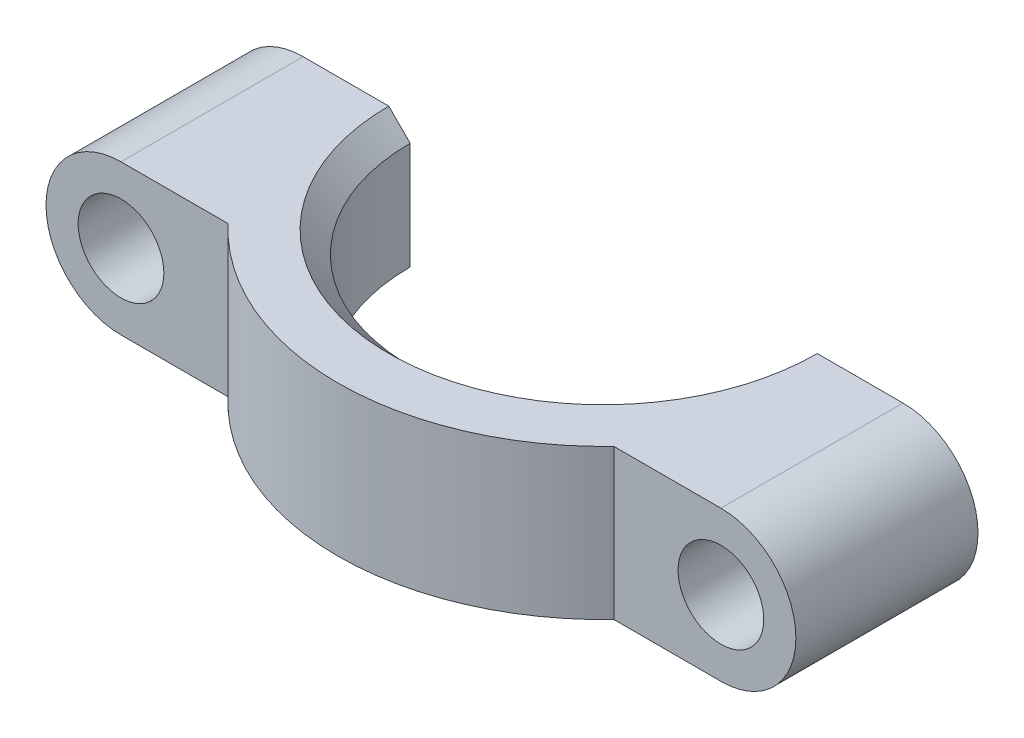
ISO-10303-21;
HEADER;
FILE_DESCRIPTION(('STEP AP214'),'2;1');
FILE_NAME('part.step','',(''),(''),'','','');
FILE_SCHEMA(('AUTOMOTIVE_DESIGN { 1 0 10303 214 1 1 1 1 }'));
ENDSEC;
DATA;
#1=APPLICATION_CONTEXT('core data for automotive mechanical design processes');
#2=APPLICATION_PROTOCOL_DEFINITION('international standard','automotive_design',2000,#1);
#3=PRODUCT_CONTEXT('',#1,'mechanical');
#4=PRODUCT('Part','Part','',(#3));
#5=PRODUCT_RELATED_PRODUCT_CATEGORY('part','',(#4));
#6=PRODUCT_DEFINITION_FORMATION('','',#4);
#7=PRODUCT_DEFINITION_CONTEXT('part definition',#1,'design');
#8=PRODUCT_DEFINITION('design','',#6,#7);
#9=PRODUCT_DEFINITION_SHAPE('','',#8);
#10=(LENGTH_UNIT() NAMED_UNIT(*) SI_UNIT(.MILLI.,.METRE.));
#11=(NAMED_UNIT(*) PLANE_ANGLE_UNIT() SI_UNIT($,.RADIAN.));
#12=(NAMED_UNIT(*) SI_UNIT($,.STERADIAN.) SOLID_ANGLE_UNIT());
#13=UNCERTAINTY_MEASURE_WITH_UNIT(LENGTH_MEASURE(1.E-05),#10,'distance_accuracy_value','');
#14=(GEOMETRIC_REPRESENTATION_CONTEXT(3) GLOBAL_UNCERTAINTY_ASSIGNED_CONTEXT((#13)) GLOBAL_UNIT_ASSIGNED_CONTEXT((#10,
#11,#12)) REPRESENTATION_CONTEXT('',''));
#15=CARTESIAN_POINT('',(0.,0.,0.));
#16=DIRECTION('',(0.,0.,1.));
#17=DIRECTION('',(1.,0.,0.));
#18=AXIS2_PLACEMENT_3D('',#15,#16,#17);
#19=CARTESIAN_POINT('',(14.0000000022828,3.5,2.1559629082013E-09));
#20=DIRECTION('',(0.,-1.,0.));
#21=DIRECTION('',(0.,0.,-1.));
#22=AXIS2_PLACEMENT_3D('',#19,#20,#21);
#23=CYLINDRICAL_SURFACE('',#22,12.3794184);
#24=CARTESIAN_POINT('',(1.62058160228278,1.17205600136793,2.15596518226357E-09));
#25=CARTESIAN_POINT('',(1.62058070106676,1.17204664313094,0.0824775925536557));
#26=CARTESIAN_POINT('',(1.62140589643494,1.1709161105799,0.164955447988266));
#27=CARTESIAN_POINT('',(1.62470168765311,1.1663441589203,0.329827057039448));
#28=CARTESIAN_POINT('',(1.62717254635869,1.16290237064286,0.412220795114308));
#29=CARTESIAN_POINT('',(1.63377268951064,1.15361142558453,0.577308928127511));
#30=CARTESIAN_POINT('',(1.63791187573793,1.14774789013258,0.660002143808955));
#31=CARTESIAN_POINT('',(1.64782891991983,1.13345955911073,0.825053900848175));
#32=CARTESIAN_POINT('',(1.65360669074367,1.1250348997254,0.907412459765));
#33=CARTESIAN_POINT('',(1.67398840396854,1.09472254150796,1.16151970390293));
#34=CARTESIAN_POINT('',(1.69133654965134,1.06818476466086,1.33257283641573));
#35=CARTESIAN_POINT('',(1.72229793291954,1.01689105610724,1.58596355240279));
#36=CARTESIAN_POINT('',(1.7334261297223,0.997906751014487,1.66980204441776));
#37=CARTESIAN_POINT('',(1.75721434762949,0.955405579054397,1.83609232104951));
#38=CARTESIAN_POINT('',(1.76987366734408,0.931890784646908,1.91854472105105));
#39=CARTESIAN_POINT('',(1.79184500230982,0.888623403614391,2.05275791223458));
#40=CARTESIAN_POINT('',(1.8007650115737,0.870464042916723,2.1050975264016));
#41=CARTESIAN_POINT('',(1.81909892254828,0.831471653186046,2.20871342381947));
#42=CARTESIAN_POINT('',(1.82851298012735,0.810637777329915,2.25998936428382));
#43=CARTESIAN_POINT('',(1.84764360380866,0.766027311175492,2.36068603645154));
#44=CARTESIAN_POINT('',(1.85735708760954,0.742276027004788,2.41011846331688));
#45=CARTESIAN_POINT('',(1.87698933162185,0.691131393325687,2.50700018681044));
#46=CARTESIAN_POINT('',(1.88690793281186,0.663740782039211,2.55445093950927));
#47=CARTESIAN_POINT('',(1.90573450500722,0.607428944012412,2.64207294426204));
#48=CARTESIAN_POINT('',(1.91464679504575,0.578916803507779,2.6825030210978));
#49=CARTESIAN_POINT('',(1.93215537892905,0.517492357770973,2.76020166434233));
#50=CARTESIAN_POINT('',(1.94075075074488,0.48456833484869,2.79746136403339));
#51=CARTESIAN_POINT('',(1.95724020985852,0.413021224620082,2.86762115631542));
#52=CARTESIAN_POINT('',(1.96512089975336,0.374315492998507,2.90044209071552));
#53=CARTESIAN_POINT('',(1.97914930554692,0.291066231692813,2.95804436551448));
#54=CARTESIAN_POINT('',(1.98530655623071,0.246556902269624,2.98287005881747));
#55=CARTESIAN_POINT('',(1.99271291764378,0.172694460427645,3.01250448217808));
#56=CARTESIAN_POINT('',(1.99493408650214,0.145051940281912,3.02133035142867));
#57=CARTESIAN_POINT('',(1.99823390396384,0.0886346171145662,3.03441208116168));
#58=CARTESIAN_POINT('',(1.99931361348157,0.0598608913273075,3.03867218528537));
#59=CARTESIAN_POINT('',(2.00020973673916,0.00188840981385083,3.04220933887906));
#60=CARTESIAN_POINT('',(2.00002206682872,-0.0273114170471196,3.04147028042818));
#61=CARTESIAN_POINT('',(1.99839728065709,-0.0851284536634222,3.03505222326563));
#62=CARTESIAN_POINT('',(1.99695935986068,-0.113745276118205,3.02937004365908));
#63=CARTESIAN_POINT('',(1.99262451982069,-0.174780535180429,3.01214623578604));
#64=CARTESIAN_POINT('',(1.98950794873546,-0.206930497204879,2.99971933775454));
#65=CARTESIAN_POINT('',(1.98211199860328,-0.268711187279559,2.96994996356882));
#66=CARTESIAN_POINT('',(1.97783056563568,-0.298337342955653,2.95259880244937));
#67=CARTESIAN_POINT('',(1.96600170967453,-0.369808072741913,2.90409774919046));
#68=CARTESIAN_POINT('',(1.95792117253801,-0.409879217855081,2.87049119072248));
#69=CARTESIAN_POINT('',(1.94082510134456,-0.484423590391346,2.7978038260427));
#70=CARTESIAN_POINT('',(1.93180725914709,-0.51888243543077,2.75870941878553));
#71=CARTESIAN_POINT('',(1.91382538555792,-0.58162297477863,2.67880293611691));
#72=CARTESIAN_POINT('',(1.90487736881377,-0.610113568270055,2.63814852994299));
#73=CARTESIAN_POINT('',(1.88694180825091,-0.66350620627804,2.55453678465069));
#74=CARTESIAN_POINT('',(1.87795423518509,-0.688404852684239,2.51157731688095));
#75=CARTESIAN_POINT('',(1.85120790764819,-0.758663560396669,2.38008927724707));
#76=CARTESIAN_POINT('',(1.83369780087158,-0.799483625970508,2.28909252169126));
#77=CARTESIAN_POINT('',(1.79818963499578,-0.876646668902664,2.09214381000132));
#78=CARTESIAN_POINT('',(1.780393072304,-0.91183432651444,1.98572249363806));
#79=CARTESIAN_POINT('',(1.74728301353439,-0.973769399639217,1.76998806146417));
#80=CARTESIAN_POINT('',(1.73197248235464,-1.00050677258096,1.66067167095143));
#81=CARTESIAN_POINT('',(1.70412746754681,-1.04722785945669,1.44010466302931));
#82=CARTESIAN_POINT('',(1.69159739419007,-1.06720087001176,1.32885127037612));
#83=CARTESIAN_POINT('',(1.66949986845427,-1.10144506807773,1.10517243298978));
#84=CARTESIAN_POINT('',(1.65993309525673,-1.11571494866171,0.992746725659151));
#85=CARTESIAN_POINT('',(1.64146247581991,-1.1427820480408,0.733540765076906));
#86=CARTESIAN_POINT('',(1.63360531527481,-1.15387387191845,0.586504482153202));
#87=CARTESIAN_POINT('',(1.62577949927132,-1.16484159824108,0.366098113739254));
#88=CARTESIAN_POINT('',(1.62383086955804,-1.16755280693986,0.292917545083328));
#89=CARTESIAN_POINT('',(1.62123189410597,-1.17115787710361,0.146493301418139));
#90=CARTESIAN_POINT('',(1.62058146270267,-1.17205185848244,0.0732496308919003));
#91=CARTESIAN_POINT('',(1.62058160228278,-1.17205600136799,2.15597160438255E-09));
#92=B_SPLINE_CURVE_WITH_KNOTS('',3,(#24,#25,#26,#27,#28,#29,#30,#31,#32,#33,#34,#35,#36,#37,#38,
#39,#40,#41,#42,#43,#44,#45,#46,#47,#48,#49,#50,#51,#52,#53,#54,#55,#56,#57,#58,#59,#60,#61,#62,
#63,#64,#65,#66,#67,#68,#69,#70,#71,#72,#73,#74,#75,#76,#77,#78,#79,#80,#81,#82,#83,#84,#85,#86,
#87,#88,#89,#90,#91),.UNSPECIFIED.,.F.,.F.,(4,2,2,2,2,2,2,2,2,2,2,2,2,2,2,2,2,2,2,2,2,2,2,2,2,2,
2,2,2,2,2,2,2,4),(0.,0.24742073320188,0.494880995463496,0.743832123687778,0.992770016560819,
1.51382281337372,1.77375838789471,2.03357533671996,2.2018566198619,2.37019131739323,
2.53715720736888,2.70399817652613,2.85458504178582,3.00558009107777,3.1589874160217,
3.31152845118714,3.39849010019237,3.48537085258451,3.57253167856633,3.65974863400002,
3.76300210331749,3.86643882563878,4.02430220545093,4.18256397699681,4.3336675201235,
4.48491308813585,4.78793247477925,5.12795273110068,5.46837557126951,5.80933457943281,
6.15037167688319,6.59301455795597,6.81275731194246,7.03248556523715),.UNSPECIFIED.);
#93=CARTESIAN_POINT('',(1.62058160228278,1.17205600136793,0.));
#94=VERTEX_POINT('',#93);
#95=CARTESIAN_POINT('',(1.62058160228278,-1.17205600136793,2.1559629082013E-09));
#96=VERTEX_POINT('',#95);
#97=EDGE_CURVE('E194',#94,#96,#92,.T.);
#98=ORIENTED_EDGE('',*,*,#97,.F.);
#99=DIRECTION('',(0.,-1.,0.));
#100=VECTOR('',#99,1.);
#101=CARTESIAN_POINT('',(1.62058160228278,3.5,2.1559629082013E-09));
#102=LINE('',#101,#100);
#103=EDGE_CURVE('E158',#94,#96,#102,.T.);
#104=ORIENTED_EDGE('',*,*,#103,.T.);
#105=EDGE_LOOP('',(#98,#104));
#106=FACE_BOUND('',#105,.T.);
#107=ADVANCED_FACE('F33',(#106),#23,.T.);
#108=CARTESIAN_POINT('',(0.,-3.50000000000001,8.5));
#109=DIRECTION('',(0.,1.,0.));
#110=DIRECTION('',(-1.,0.,0.));
#111=AXIS2_PLACEMENT_3D('',#108,#109,#110);
#112=PLANE('',#111);
#113=DIRECTION('',(1.,0.,0.));
#114=VECTOR('',#113,1.);
#115=CARTESIAN_POINT('',(1.62058160228278,-3.5,2.1559629082013E-09));
#116=LINE('',#115,#114);
#117=CARTESIAN_POINT('',(0.,-3.5,0.));
#118=VERTEX_POINT('',#117);
#119=CARTESIAN_POINT('',(4.00000000228278,-3.5,2.1559629082013E-09));
#120=VERTEX_POINT('',#119);
#121=EDGE_CURVE('E151',#118,#120,#116,.T.);
#122=ORIENTED_EDGE('',*,*,#121,.T.);
#123=CARTESIAN_POINT('',(14.0000000022828,-3.50000000000001,2.1559629082013E-09));
#124=DIRECTION('',(0.,1.,0.));
#125=DIRECTION('',(-1.,0.,0.));
#126=AXIS2_PLACEMENT_3D('',#123,#124,#125);
#127=CIRCLE('',#126,10.);
#128=CARTESIAN_POINT('',(24.0000000022828,-3.5,0.));
#129=VERTEX_POINT('',#128);
#130=EDGE_CURVE('E11',#120,#129,#127,.T.);
#131=ORIENTED_EDGE('',*,*,#130,.T.);
#132=DIRECTION('',(1.,0.,0.));
#133=VECTOR('',#132,1.);
#134=CARTESIAN_POINT('',(0.,-3.50000000000001,0.));
#135=LINE('',#134,#133);
#136=CARTESIAN_POINT('',(28.,-3.5,0.));
#137=VERTEX_POINT('',#136);
#138=EDGE_CURVE('E241',#129,#137,#135,.T.);
#139=ORIENTED_EDGE('',*,*,#138,.T.);
#140=DIRECTION('',(0.,0.,-1.));
#141=VECTOR('',#140,1.);
#142=CARTESIAN_POINT('',(28.,-3.5,8.5));
#143=LINE('',#142,#141);
#144=CARTESIAN_POINT('',(28.,-3.5,8.5));
#145=VERTEX_POINT('',#144);
#146=EDGE_CURVE('E203',#145,#137,#143,.T.);
#147=ORIENTED_EDGE('',*,*,#146,.F.);
#148=DIRECTION('',(1.,0.,0.));
#149=VECTOR('',#148,1.);
#150=CARTESIAN_POINT('',(0.,-3.50000000000001,8.5));
#151=LINE('',#150,#149);
#152=CARTESIAN_POINT('',(23.,-3.5,8.5));
#153=VERTEX_POINT('',#152);
#154=EDGE_CURVE('E264',#153,#145,#151,.T.);
#155=ORIENTED_EDGE('',*,*,#154,.F.);
#156=CARTESIAN_POINT('',(14.0000000022828,-3.5,2.1559629082013E-09));
#157=DIRECTION('',(0.,-1.,0.));
#158=DIRECTION('',(0.,0.,-1.));
#159=AXIS2_PLACEMENT_3D('',#156,#157,#158);
#160=CIRCLE('',#159,12.3794184);
#161=CARTESIAN_POINT('',(5.00000000456556,-3.5,8.5));
#162=VERTEX_POINT('',#161);
#163=EDGE_CURVE('E148',#153,#162,#160,.T.);
#164=ORIENTED_EDGE('',*,*,#163,.T.);
#165=DIRECTION('',(-1.,0.,0.));
#166=VECTOR('',#165,1.);
#167=CARTESIAN_POINT('',(0.,-3.5,8.5));
#168=LINE('',#167,#166);
#169=CARTESIAN_POINT('',(0.,-3.5,8.5));
#170=VERTEX_POINT('',#169);
#171=EDGE_CURVE('E135',#162,#170,#168,.T.);
#172=ORIENTED_EDGE('',*,*,#171,.T.);
#173=DIRECTION('',(0.,0.,-1.));
#174=VECTOR('',#173,1.);
#175=CARTESIAN_POINT('',(0.,-3.5,8.5));
#176=LINE('',#175,#174);
#177=EDGE_CURVE('E131',#170,#118,#176,.T.);
#178=ORIENTED_EDGE('',*,*,#177,.T.);
#179=EDGE_LOOP('',(#122,#131,#139,#147,#155,#164,#172,#178));
#180=FACE_BOUND('',#179,.T.);
#181=ADVANCED_FACE('F221',(#180),#112,.F.);
#182=CARTESIAN_POINT('',(28.,0.,8.5));
#183=DIRECTION('',(0.,0.,-1.));
#184=DIRECTION('',(-1.,0.,0.));
#185=AXIS2_PLACEMENT_3D('',#182,#183,#184);
#186=CYLINDRICAL_SURFACE('',#185,3.5);
#187=CARTESIAN_POINT('',(28.,0.,0.));
#188=DIRECTION('',(0.,0.,1.));
#189=DIRECTION('',(1.,0.,0.));
#190=AXIS2_PLACEMENT_3D('',#187,#188,#189);
#191=CIRCLE('',#190,3.5);
#192=CARTESIAN_POINT('',(28.,3.5,0.));
#193=VERTEX_POINT('',#192);
#194=EDGE_CURVE('E243',#137,#193,#191,.T.);
#195=ORIENTED_EDGE('',*,*,#194,.T.);
#196=DIRECTION('',(0.,0.,-1.));
#197=VECTOR('',#196,1.);
#198=CARTESIAN_POINT('',(28.,3.5,8.5));
#199=LINE('',#198,#197);
#200=CARTESIAN_POINT('',(28.,3.5,8.5));
#201=VERTEX_POINT('',#200);
#202=EDGE_CURVE('E255',#201,#193,#199,.T.);
#203=ORIENTED_EDGE('',*,*,#202,.F.);
#204=CARTESIAN_POINT('',(28.,0.,8.5));
#205=DIRECTION('',(0.,0.,1.));
#206=DIRECTION('',(1.,0.,0.));
#207=AXIS2_PLACEMENT_3D('',#204,#205,#206);
#208=CIRCLE('',#207,3.5);
#209=EDGE_CURVE('E262',#145,#201,#208,.T.);
#210=ORIENTED_EDGE('',*,*,#209,.F.);
#211=ORIENTED_EDGE('',*,*,#146,.T.);
#212=EDGE_LOOP('',(#195,#203,#210,#211));
#213=FACE_BOUND('',#212,.T.);
#214=ADVANCED_FACE('F226',(#213),#186,.T.);
#215=CARTESIAN_POINT('',(0.,3.5,8.5));
#216=DIRECTION('',(0.,1.,0.));
#217=DIRECTION('',(0.,0.,1.));
#218=AXIS2_PLACEMENT_3D('',#215,#216,#217);
#219=PLANE('',#218);
#220=DIRECTION('',(1.,0.,0.));
#221=VECTOR('',#220,1.);
#222=CARTESIAN_POINT('',(0.,3.5,0.));
#223=LINE('',#222,#221);
#224=CARTESIAN_POINT('',(24.0000000022828,3.5,0.));
#225=VERTEX_POINT('',#224);
#226=EDGE_CURVE('E251',#225,#193,#223,.T.);
#227=ORIENTED_EDGE('',*,*,#226,.F.);
#228=CARTESIAN_POINT('',(14.0000000022828,3.5,2.1559629082013E-09));
#229=DIRECTION('',(0.,1.,0.));
#230=DIRECTION('',(0.,0.,1.));
#231=AXIS2_PLACEMENT_3D('',#228,#229,#230);
#232=CIRCLE('',#231,9.99999999999999);
#233=CARTESIAN_POINT('',(4.00000000228279,3.5,2.1559629082013E-09));
#234=VERTEX_POINT('',#233);
#235=EDGE_CURVE('E56',#225,#234,#232,.F.);
#236=ORIENTED_EDGE('',*,*,#235,.T.);
#237=DIRECTION('',(1.,0.,0.));
#238=VECTOR('',#237,1.);
#239=CARTESIAN_POINT('',(1.62058160228278,3.5,2.1559629082013E-09));
#240=LINE('',#239,#238);
#241=CARTESIAN_POINT('',(0.,3.5,0.));
#242=VERTEX_POINT('',#241);
#243=EDGE_CURVE('E146',#242,#234,#240,.T.);
#244=ORIENTED_EDGE('',*,*,#243,.F.);
#245=DIRECTION('',(0.,0.,-1.));
#246=VECTOR('',#245,1.);
#247=CARTESIAN_POINT('',(0.,3.5,8.5));
#248=LINE('',#247,#246);
#249=CARTESIAN_POINT('',(0.,3.5,8.5));
#250=VERTEX_POINT('',#249);
#251=EDGE_CURVE('E129',#250,#242,#248,.T.);
#252=ORIENTED_EDGE('',*,*,#251,.F.);
#253=DIRECTION('',(-1.,0.,0.));
#254=VECTOR('',#253,1.);
#255=CARTESIAN_POINT('',(0.,3.5,8.5));
#256=LINE('',#255,#254);
#257=CARTESIAN_POINT('',(5.00000000456556,3.5,8.5));
#258=VERTEX_POINT('',#257);
#259=EDGE_CURVE('E136',#258,#250,#256,.T.);
#260=ORIENTED_EDGE('',*,*,#259,.F.);
#261=CARTESIAN_POINT('',(14.0000000022828,3.5,2.1559629082013E-09));
#262=DIRECTION('',(0.,-1.,0.));
#263=DIRECTION('',(0.,0.,-1.));
#264=AXIS2_PLACEMENT_3D('',#261,#262,#263);
#265=CIRCLE('',#264,12.3794184);
#266=CARTESIAN_POINT('',(23.,3.5,8.5));
#267=VERTEX_POINT('',#266);
#268=EDGE_CURVE('E156',#267,#258,#265,.T.);
#269=ORIENTED_EDGE('',*,*,#268,.F.);
#270=DIRECTION('',(1.,0.,0.));
#271=VECTOR('',#270,1.);
#272=CARTESIAN_POINT('',(0.,3.5,8.5));
#273=LINE('',#272,#271);
#274=EDGE_CURVE('E260',#267,#201,#273,.T.);
#275=ORIENTED_EDGE('',*,*,#274,.T.);
#276=ORIENTED_EDGE('',*,*,#202,.T.);
#277=EDGE_LOOP('',(#227,#236,#244,#252,#260,#269,#275,#276));
#278=FACE_BOUND('',#277,.T.);
#279=ADVANCED_FACE('F145',(#278),#219,.T.);
#280=CARTESIAN_POINT('',(28.,0.,8.5));
#281=DIRECTION('',(0.,0.,-1.));
#282=DIRECTION('',(-1.,0.,0.));
#283=AXIS2_PLACEMENT_3D('',#280,#281,#282);
#284=CYLINDRICAL_SURFACE('',#283,2.);
#285=CARTESIAN_POINT('',(26.3794184022828,1.17205600768065,0.));
#286=CARTESIAN_POINT('',(26.3794193035132,1.17204664946367,0.0824775904003453));
#287=CARTESIAN_POINT('',(26.3785941081593,1.17091611694164,0.164955445838006));
#288=CARTESIAN_POINT('',(26.3752983169696,1.16634416535954,0.329827054896737));
#289=CARTESIAN_POINT('',(26.3728274582781,1.16290237713062,0.412220792976098));
#290=CARTESIAN_POINT('',(26.366227315155,1.15361143219178,0.577308925982704));
#291=CARTESIAN_POINT('',(26.3620881289427,1.14774789681147,0.660002141653115));
#292=CARTESIAN_POINT('',(26.3521710847908,1.13345956595847,0.825053898675814));
#293=CARTESIAN_POINT('',(26.3463933139819,1.12503490667035,0.907412457587149));
#294=CARTESIAN_POINT('',(26.3260116008071,1.09472254880513,1.16151970166571));
#295=CARTESIAN_POINT('',(26.308663455161,1.06818477226626,1.33257283413587));
#296=CARTESIAN_POINT('',(26.2777020719399,1.01689106433426,1.58596355012777));
#297=CARTESIAN_POINT('',(26.2665738751509,0.997906759473828,1.66980204215937));
#298=CARTESIAN_POINT('',(26.242785657265,0.955405588050314,1.83609231885765));
#299=CARTESIAN_POINT('',(26.230126337558,0.931890793946953,1.91854471890905));
#300=CARTESIAN_POINT('',(26.2081550023835,0.888623413083745,2.05275791151023));
#301=CARTESIAN_POINT('',(26.199234992893,0.870464052165605,2.10509752700798));
#302=CARTESIAN_POINT('',(26.1809010814349,0.831471661909236,2.20871342706345));
#303=CARTESIAN_POINT('',(26.1714870235988,0.810637785747833,2.25998936883464));
#304=CARTESIAN_POINT('',(26.1523563993813,0.766027318883259,2.36068604356075));
#305=CARTESIAN_POINT('',(26.1426429153016,0.742276034308938,2.41011847167814));
#306=CARTESIAN_POINT('',(26.1230106707144,0.691131399691974,2.50700019761553));
#307=CARTESIAN_POINT('',(26.1130920692283,0.663740787871481,2.55445095150626));
#308=CARTESIAN_POINT('',(26.094265496708,0.607428949386754,2.64207295730825));
#309=CARTESIAN_POINT('',(26.0853532066399,0.578916809071223,2.68250303407211));
#310=CARTESIAN_POINT('',(26.0678446226862,0.517492363789,2.7602016772408));
#311=CARTESIAN_POINT('',(26.0592492508295,0.484568341132973,2.79746137692854));
#312=CARTESIAN_POINT('',(26.0427597916134,0.413021231565245,2.86762116930787));
#313=CARTESIAN_POINT('',(26.0348791016558,0.374315500344527,2.90044210381533));
#314=CARTESIAN_POINT('',(26.0208506956724,0.291066239927869,2.95804437911549));
#315=CARTESIAN_POINT('',(26.0146934448625,0.246556910989764,2.98287007280753));
#316=CARTESIAN_POINT('',(26.0072870831401,0.172694469491324,3.01250449725327));
#317=CARTESIAN_POINT('',(26.0050659141431,0.145051949195008,3.0213303670069));
#318=CARTESIAN_POINT('',(26.0017660964118,0.0886346256457131,3.03441209773505));
#319=CARTESIAN_POINT('',(26.0006863867629,0.0598608996272375,3.03867220235117));
#320=CARTESIAN_POINT('',(25.999790263264,0.00188841754745736,3.04220935687568));
#321=CARTESIAN_POINT('',(25.999977933065,-0.027311409649074,3.04147029886048));
#322=CARTESIAN_POINT('',(26.0016027190538,-0.0851284470007324,3.03505224246207));
#323=CARTESIAN_POINT('',(26.0030406397769,-0.113745269855378,3.02937006318414));
#324=CARTESIAN_POINT('',(26.0073754796608,-0.174780529252891,3.01214625605142));
#325=CARTESIAN_POINT('',(26.0104920506451,-0.206930491249671,2.99971935851197));
#326=CARTESIAN_POINT('',(26.0178880005919,-0.268711181342522,2.96994998529749));
#327=CARTESIAN_POINT('',(26.0221694334749,-0.298337337064752,2.95259882465749));
#328=CARTESIAN_POINT('',(26.0339982891818,-0.369808066623053,2.90409777283835));
#329=CARTESIAN_POINT('',(26.0420788261449,-0.409879211548336,2.87049121538804));
#330=CARTESIAN_POINT('',(26.0591748970231,-0.484423583839509,2.79780385274339));
#331=CARTESIAN_POINT('',(26.0681927390787,-0.518882428822178,2.75870944650379));
#332=CARTESIAN_POINT('',(26.086174612349,-0.58162296787379,2.67880296613982));
#333=CARTESIAN_POINT('',(26.0951226289117,-0.610113561159058,2.63814856128155));
#334=CARTESIAN_POINT('',(26.113058189143,-0.663506198858346,2.55453681863476));
#335=CARTESIAN_POINT('',(26.1220457620588,-0.688404845162154,2.51157735219492));
#336=CARTESIAN_POINT('',(26.1487920891957,-0.758663552680368,2.38008931656124));
#337=CARTESIAN_POINT('',(26.1663021957734,-0.799483618277577,2.28909256367959));
#338=CARTESIAN_POINT('',(26.2018103613162,-0.876646661334341,2.09214385797054));
#339=CARTESIAN_POINT('',(26.2196069238979,-0.911834319107287,1.98572254492582));
#340=CARTESIAN_POINT('',(26.2527169826359,-0.973769392776036,1.76998811937772));
#341=CARTESIAN_POINT('',(26.2680275138944,-1.00050676610088,1.66067173217219));
#342=CARTESIAN_POINT('',(26.2958725290507,-1.04722785393321,1.44010473081295));
#343=CARTESIAN_POINT('',(26.3084026026768,-1.06720086506012,1.32885134141487));
#344=CARTESIAN_POINT('',(26.3305001291348,-1.10144506443675,1.10517251050438));
#345=CARTESIAN_POINT('',(26.3400669027851,-1.11571494575939,0.992746806394442));
#346=CARTESIAN_POINT('',(26.3585375247534,-1.14278204892447,0.733540835130711));
#347=CARTESIAN_POINT('',(26.3663946868043,-1.15387387487722,0.586504538133857));
#348=CARTESIAN_POINT('',(26.3742205043034,-1.16484160323252,0.36609814862725));
#349=CARTESIAN_POINT('',(26.3761691343881,-1.16755281242899,0.292917573002975));
#350=CARTESIAN_POINT('',(26.3787681103355,-1.17115788325264,0.146493315386422));
#351=CARTESIAN_POINT('',(26.3794185418629,-1.17205186479378,0.0732496378771715));
#352=CARTESIAN_POINT('',(26.3794184022828,-1.17205600768071,2.15596845168844E-09));
#353=B_SPLINE_CURVE_WITH_KNOTS('',3,(#285,#286,#287,#288,#289,#290,#291,#292,#293,#294,#295,
#296,#297,#298,#299,#300,#301,#302,#303,#304,#305,#306,#307,#308,#309,#310,#311,#312,#313,#314,
#315,#316,#317,#318,#319,#320,#321,#322,#323,#324,#325,#326,#327,#328,#329,#330,#331,#332,#333,
#334,#335,#336,#337,#338,#339,#340,#341,#342,#343,#344,#345,#346,#347,#348,#349,#350,#351,#352),
.UNSPECIFIED.,.F.,.F.,(4,2,2,2,2,2,2,2,2,2,2,2,2,2,2,2,2,2,2,2,2,2,2,2,2,2,2,2,2,2,2,2,2,4),(0.,
0.24742073320995,0.494880995478222,0.743832123653006,0.992770016477163,1.51382281302971,
1.7737583874435,2.03357533616705,2.20185662335233,2.37019132492985,2.53715721889675,
2.70399819203628,2.85458505682386,3.0055801056222,3.15898742992656,3.31152846451935,
3.39849011444396,3.48537086774924,3.57253169469136,3.65974865108222,3.76300211977065,
3.86643884145528,4.02430221883642,4.18256398794185,4.33366752744785,4.48491309183405,
4.78793247120491,5.12795271830078,5.46837554923153,5.80933454823881,6.15037163654183,
6.59301456025162,6.81275733519947,7.03248560944301),.UNSPECIFIED.);
#354=CARTESIAN_POINT('',(26.3794184022828,1.17205600768065,2.1559629082013E-09));
#355=VERTEX_POINT('',#354);
#356=CARTESIAN_POINT('',(26.3794184022828,-1.17205600768065,0.));
#357=VERTEX_POINT('',#356);
#358=EDGE_CURVE('E163',#355,#357,#353,.T.);
#359=ORIENTED_EDGE('',*,*,#358,.F.);
#360=CARTESIAN_POINT('',(28.,0.,0.));
#361=DIRECTION('',(0.,0.,1.));
#362=DIRECTION('',(1.,0.,0.));
#363=AXIS2_PLACEMENT_3D('',#360,#361,#362);
#364=CIRCLE('',#363,2.);
#365=EDGE_CURVE('E174',#357,#355,#364,.T.);
#366=ORIENTED_EDGE('',*,*,#365,.F.);
#367=EDGE_LOOP('',(#359,#366));
#368=FACE_BOUND('',#367,.T.);
#369=CARTESIAN_POINT('',(28.,0.,8.5));
#370=DIRECTION('',(0.,0.,1.));
#371=DIRECTION('',(1.,0.,0.));
#372=AXIS2_PLACEMENT_3D('',#369,#370,#371);
#373=CIRCLE('',#372,2.);
#374=CARTESIAN_POINT('',(30.,0.,8.5));
#375=VERTEX_POINT('',#374);
#376=EDGE_CURVE('E175',#375,#375,#373,.T.);
#377=ORIENTED_EDGE('',*,*,#376,.T.);
#378=EDGE_LOOP('',(#377));
#379=FACE_BOUND('',#378,.T.);
#380=ADVANCED_FACE('F177',(#368,#379),#284,.F.);
#381=CARTESIAN_POINT('',(0.,0.,8.5));
#382=DIRECTION('',(0.,0.,1.));
#383=DIRECTION('',(1.,0.,0.));
#384=AXIS2_PLACEMENT_3D('',#381,#382,#383);
#385=PLANE('',#384);
#386=ORIENTED_EDGE('',*,*,#376,.F.);
#387=EDGE_LOOP('',(#386));
#388=FACE_BOUND('',#387,.T.);
#389=ORIENTED_EDGE('',*,*,#154,.T.);
#390=ORIENTED_EDGE('',*,*,#209,.T.);
#391=ORIENTED_EDGE('',*,*,#274,.F.);
#392=DIRECTION('',(0.,1.,0.));
#393=VECTOR('',#392,1.);
#394=CARTESIAN_POINT('',(23.,0.,8.5));
#395=LINE('',#394,#393);
#396=EDGE_CURVE('E246',#153,#267,#395,.T.);
#397=ORIENTED_EDGE('',*,*,#396,.F.);
#398=EDGE_LOOP('',(#389,#390,#391,#397));
#399=FACE_BOUND('',#398,.T.);
#400=ADVANCED_FACE('F190',(#388,#399),#385,.T.);
#401=CARTESIAN_POINT('',(0.,0.,0.));
#402=DIRECTION('',(0.,0.,1.));
#403=DIRECTION('',(1.,0.,0.));
#404=AXIS2_PLACEMENT_3D('',#401,#402,#403);
#405=PLANE('',#404);
#406=ORIENTED_EDGE('',*,*,#365,.T.);
#407=DIRECTION('',(0.,-1.,0.));
#408=VECTOR('',#407,1.);
#409=CARTESIAN_POINT('',(26.3794184022828,3.5,2.1559629082013E-09));
#410=LINE('',#409,#408);
#411=EDGE_CURVE('E161',#355,#357,#410,.T.);
#412=ORIENTED_EDGE('',*,*,#411,.T.);
#413=EDGE_LOOP('',(#406,#412));
#414=FACE_BOUND('',#413,.T.);
#415=DIRECTION('',(0.,1.,0.));
#416=VECTOR('',#415,1.);
#417=CARTESIAN_POINT('',(23.,0.,0.));
#418=LINE('',#417,#416);
#419=CARTESIAN_POINT('',(23.,-2.5,0.));
#420=VERTEX_POINT('',#419);
#421=CARTESIAN_POINT('',(23.,2.49999999771722,0.));
#422=VERTEX_POINT('',#421);
#423=EDGE_CURVE('E253',#420,#422,#418,.T.);
#424=ORIENTED_EDGE('',*,*,#423,.T.);
#425=DIRECTION('',(0.707106781186549,0.707106781186546,0.));
#426=VECTOR('',#425,1.);
#427=CARTESIAN_POINT('',(14.0000000022828,-6.49999999999996,0.));
#428=LINE('',#427,#426);
#429=EDGE_CURVE('E291',#422,#225,#428,.T.);
#430=ORIENTED_EDGE('',*,*,#429,.T.);
#431=ORIENTED_EDGE('',*,*,#226,.T.);
#432=ORIENTED_EDGE('',*,*,#194,.F.);
#433=ORIENTED_EDGE('',*,*,#138,.F.);
#434=DIRECTION('',(-0.707106781186547,0.707106781186548,0.));
#435=VECTOR('',#434,1.);
#436=CARTESIAN_POINT('',(14.0000000022828,6.50000000000001,0.));
#437=LINE('',#436,#435);
#438=EDGE_CURVE('E299',#129,#420,#437,.T.);
#439=ORIENTED_EDGE('',*,*,#438,.T.);
#440=EDGE_LOOP('',(#424,#430,#431,#432,#433,#439));
#441=FACE_BOUND('',#440,.T.);
#442=ADVANCED_FACE('F217',(#414,#441),#405,.F.);
#443=CARTESIAN_POINT('',(1.62058160228278,3.5,2.1559629082013E-09));
#444=DIRECTION('',(0.,0.,-1.));
#445=DIRECTION('',(-1.,0.,0.));
#446=AXIS2_PLACEMENT_3D('',#443,#444,#445);
#447=PLANE('',#446);
#448=ORIENTED_EDGE('',*,*,#103,.F.);
#449=CARTESIAN_POINT('',(0.,0.,0.));
#450=DIRECTION('',(0.,0.,1.));
#451=DIRECTION('',(1.,0.,0.));
#452=AXIS2_PLACEMENT_3D('',#449,#450,#451);
#453=CIRCLE('',#452,2.);
#454=EDGE_CURVE('E308',#94,#96,#453,.T.);
#455=ORIENTED_EDGE('',*,*,#454,.T.);
#456=EDGE_LOOP('',(#448,#455));
#457=FACE_BOUND('',#456,.T.);
#458=ORIENTED_EDGE('',*,*,#243,.T.);
#459=DIRECTION('',(-0.707106781186549,0.707106781186546,0.));
#460=VECTOR('',#459,1.);
#461=CARTESIAN_POINT('',(14.0000000022828,-6.49999999999996,2.1559629082013E-09));
#462=LINE('',#461,#460);
#463=CARTESIAN_POINT('',(5.00000000228279,2.5,2.1559629082013E-09));
#464=VERTEX_POINT('',#463);
#465=EDGE_CURVE('E41',#234,#464,#462,.F.);
#466=ORIENTED_EDGE('',*,*,#465,.T.);
#467=DIRECTION('',(0.,-1.,0.));
#468=VECTOR('',#467,1.);
#469=CARTESIAN_POINT('',(5.00000000228278,3.5,2.1559629082013E-09));
#470=LINE('',#469,#468);
#471=CARTESIAN_POINT('',(5.00000000228279,-2.49999999999999,2.1559629082013E-09));
#472=VERTEX_POINT('',#471);
#473=EDGE_CURVE('E164',#464,#472,#470,.T.);
#474=ORIENTED_EDGE('',*,*,#473,.T.);
#475=DIRECTION('',(0.707106781186547,0.707106781186548,0.));
#476=VECTOR('',#475,1.);
#477=CARTESIAN_POINT('',(14.0000000022828,6.50000000000001,2.1559629082013E-09));
#478=LINE('',#477,#476);
#479=EDGE_CURVE('E48',#472,#120,#478,.F.);
#480=ORIENTED_EDGE('',*,*,#479,.T.);
#481=ORIENTED_EDGE('',*,*,#121,.F.);
#482=CARTESIAN_POINT('',(0.,0.,0.));
#483=DIRECTION('',(0.,0.,1.));
#484=DIRECTION('',(1.,0.,0.));
#485=AXIS2_PLACEMENT_3D('',#482,#483,#484);
#486=CIRCLE('',#485,3.5);
#487=EDGE_CURVE('E307',#242,#118,#486,.T.);
#488=ORIENTED_EDGE('',*,*,#487,.F.);
#489=EDGE_LOOP('',(#458,#466,#474,#480,#481,#488));
#490=FACE_BOUND('',#489,.T.);
#491=ADVANCED_FACE('F188',(#457,#490),#447,.T.);
#492=CARTESIAN_POINT('',(14.0000000022828,3.5,2.1559629082013E-09));
#493=DIRECTION('',(0.,-1.,0.));
#494=DIRECTION('',(0.,0.,-1.));
#495=AXIS2_PLACEMENT_3D('',#492,#493,#494);
#496=CYLINDRICAL_SURFACE('',#495,9.);
#497=ORIENTED_EDGE('',*,*,#473,.F.);
#498=CARTESIAN_POINT('',(14.0000000022828,2.50000000000001,2.1559629082013E-09));
#499=DIRECTION('',(0.,1.,0.));
#500=DIRECTION('',(0.,0.,1.));
#501=AXIS2_PLACEMENT_3D('',#498,#499,#500);
#502=CIRCLE('',#501,9.);
#503=EDGE_CURVE('E303',#464,#422,#502,.T.);
#504=ORIENTED_EDGE('',*,*,#503,.T.);
#505=ORIENTED_EDGE('',*,*,#423,.F.);
#506=CARTESIAN_POINT('',(14.0000000022828,-2.5,2.1559629082013E-09));
#507=DIRECTION('',(0.,1.,0.));
#508=DIRECTION('',(0.,0.,1.));
#509=AXIS2_PLACEMENT_3D('',#506,#507,#508);
#510=CIRCLE('',#509,9.);
#511=EDGE_CURVE('E202',#420,#472,#510,.F.);
#512=ORIENTED_EDGE('',*,*,#511,.T.);
#513=EDGE_LOOP('',(#497,#504,#505,#512));
#514=FACE_BOUND('',#513,.T.);
#515=ADVANCED_FACE('F186',(#514),#496,.F.);
#516=DIRECTION('',(0.,-1.,0.));
#517=VECTOR('',#516,1.);
#518=CARTESIAN_POINT('',(5.,0.,8.5));
#519=LINE('',#518,#517);
#520=EDGE_CURVE('E141',#258,#162,#519,.T.);
#521=ORIENTED_EDGE('',*,*,#520,.T.);
#522=ORIENTED_EDGE('',*,*,#163,.F.);
#523=ORIENTED_EDGE('',*,*,#396,.T.);
#524=ORIENTED_EDGE('',*,*,#268,.T.);
#525=EDGE_LOOP('',(#521,#522,#523,#524));
#526=FACE_BOUND('',#525,.T.);
#527=ADVANCED_FACE('F180',(#526),#23,.T.);
#528=ORIENTED_EDGE('',*,*,#411,.F.);
#529=ORIENTED_EDGE('',*,*,#358,.T.);
#530=EDGE_LOOP('',(#528,#529));
#531=FACE_BOUND('',#530,.T.);
#532=ADVANCED_FACE('F185',(#531),#23,.T.);
#533=CARTESIAN_POINT('',(0.,0.,8.5));
#534=DIRECTION('',(0.,0.,-1.));
#535=DIRECTION('',(-1.,0.,0.));
#536=AXIS2_PLACEMENT_3D('',#533,#534,#535);
#537=CYLINDRICAL_SURFACE('',#536,3.5);
#538=ORIENTED_EDGE('',*,*,#487,.T.);
#539=ORIENTED_EDGE('',*,*,#177,.F.);
#540=CARTESIAN_POINT('',(0.,0.,8.5));
#541=DIRECTION('',(0.,0.,1.));
#542=DIRECTION('',(1.,0.,0.));
#543=AXIS2_PLACEMENT_3D('',#540,#541,#542);
#544=CIRCLE('',#543,3.5);
#545=EDGE_CURVE('E124',#250,#170,#544,.T.);
#546=ORIENTED_EDGE('',*,*,#545,.F.);
#547=ORIENTED_EDGE('',*,*,#251,.T.);
#548=EDGE_LOOP('',(#538,#539,#546,#547));
#549=FACE_BOUND('',#548,.T.);
#550=ADVANCED_FACE('F127',(#549),#537,.T.);
#551=CARTESIAN_POINT('',(0.,0.,8.5));
#552=DIRECTION('',(0.,0.,-1.));
#553=DIRECTION('',(-1.,0.,0.));
#554=AXIS2_PLACEMENT_3D('',#551,#552,#553);
#555=CYLINDRICAL_SURFACE('',#554,2.);
#556=CARTESIAN_POINT('',(0.,0.,8.5));
#557=DIRECTION('',(0.,0.,1.));
#558=DIRECTION('',(1.,0.,0.));
#559=AXIS2_PLACEMENT_3D('',#556,#557,#558);
#560=CIRCLE('',#559,2.);
#561=CARTESIAN_POINT('',(2.,0.,8.5));
#562=VERTEX_POINT('',#561);
#563=EDGE_CURVE('E143',#562,#562,#560,.T.);
#564=ORIENTED_EDGE('',*,*,#563,.T.);
#565=EDGE_LOOP('',(#564));
#566=FACE_BOUND('',#565,.T.);
#567=ORIENTED_EDGE('',*,*,#454,.F.);
#568=ORIENTED_EDGE('',*,*,#97,.T.);
#569=EDGE_LOOP('',(#567,#568));
#570=FACE_BOUND('',#569,.T.);
#571=ADVANCED_FACE('F206',(#566,#570),#555,.F.);
#572=CARTESIAN_POINT('',(0.,0.,8.5));
#573=DIRECTION('',(0.,0.,1.));
#574=DIRECTION('',(1.,0.,0.));
#575=AXIS2_PLACEMENT_3D('',#572,#573,#574);
#576=PLANE('',#575);
#577=ORIENTED_EDGE('',*,*,#563,.F.);
#578=EDGE_LOOP('',(#577));
#579=FACE_BOUND('',#578,.T.);
#580=ORIENTED_EDGE('',*,*,#259,.T.);
#581=ORIENTED_EDGE('',*,*,#545,.T.);
#582=ORIENTED_EDGE('',*,*,#171,.F.);
#583=ORIENTED_EDGE('',*,*,#520,.F.);
#584=EDGE_LOOP('',(#580,#581,#582,#583));
#585=FACE_BOUND('',#584,.T.);
#586=ADVANCED_FACE('F140',(#579,#585),#576,.T.);
#587=CARTESIAN_POINT('',(14.0000000022828,2.50000000000001,2.1559629082013E-09));
#588=DIRECTION('',(0.,1.,0.));
#589=DIRECTION('',(0.,0.,1.));
#590=AXIS2_PLACEMENT_3D('',#587,#588,#589);
#591=CONICAL_SURFACE('',#590,9.,0.78539816339745);
#592=ORIENTED_EDGE('',*,*,#465,.F.);
#593=ORIENTED_EDGE('',*,*,#235,.F.);
#594=ORIENTED_EDGE('',*,*,#429,.F.);
#595=ORIENTED_EDGE('',*,*,#503,.F.);
#596=EDGE_LOOP('',(#592,#593,#594,#595));
#597=FACE_BOUND('',#596,.T.);
#598=ADVANCED_FACE('F294',(#597),#591,.F.);
#599=CARTESIAN_POINT('',(14.0000000022828,-3.50000000000001,2.1559629082013E-09));
#600=DIRECTION('',(0.,-1.,0.));
#601=DIRECTION('',(0.,0.,-1.));
#602=AXIS2_PLACEMENT_3D('',#599,#600,#601);
#603=CONICAL_SURFACE('',#602,10.,0.785398163397448);
#604=ORIENTED_EDGE('',*,*,#479,.F.);
#605=ORIENTED_EDGE('',*,*,#511,.F.);
#606=ORIENTED_EDGE('',*,*,#438,.F.);
#607=ORIENTED_EDGE('',*,*,#130,.F.);
#608=EDGE_LOOP('',(#604,#605,#606,#607));
#609=FACE_BOUND('',#608,.T.);
#610=ADVANCED_FACE('F35',(#609),#603,.F.);
#611=CLOSED_SHELL('',(#107,#181,#214,#279,#380,#400,#442,#491,#515,#527,#532,#550,#571,#586,
#598,#610));
#612=MANIFOLD_SOLID_BREP('B2',#611);
#613=ADVANCED_BREP_SHAPE_REPRESENTATION('',(#18,#612),#14);
#614=SHAPE_DEFINITION_REPRESENTATION(#9,#613);
ENDSEC;
END-ISO-10303-21;
